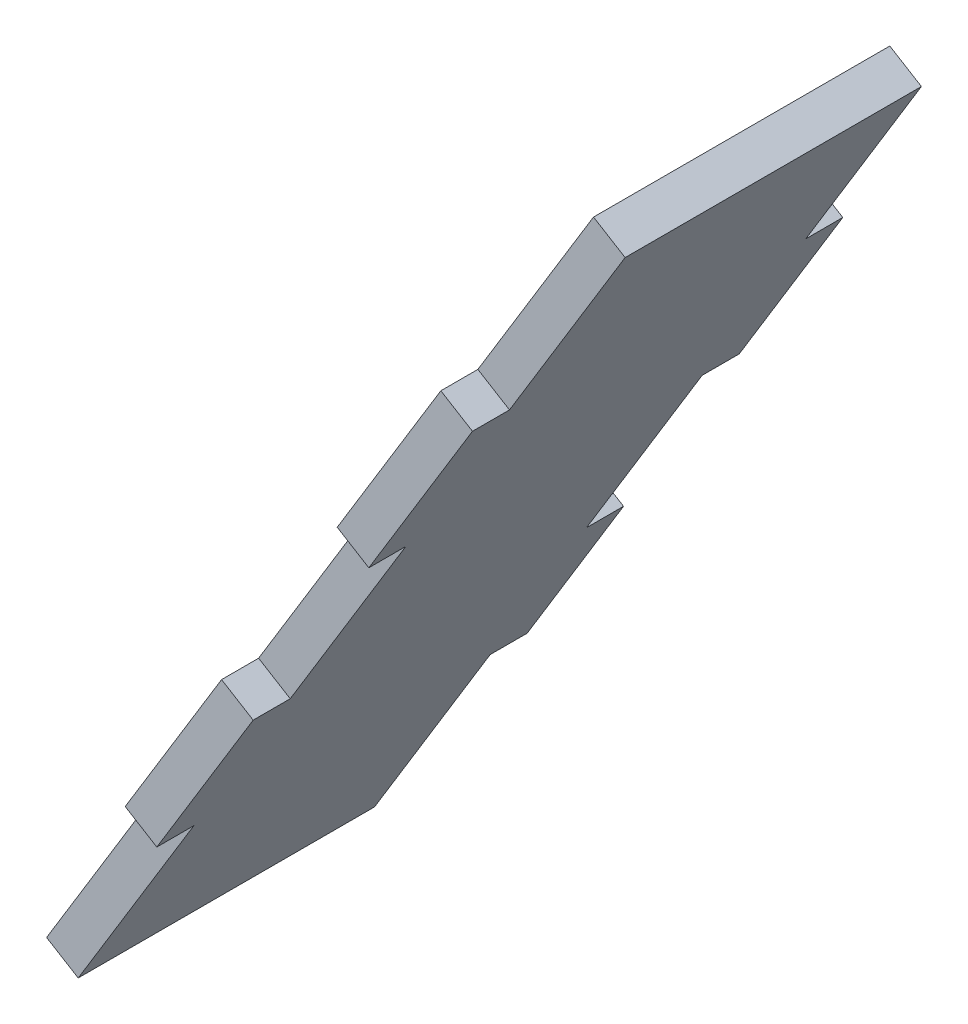
ISO-10303-21;
HEADER;
FILE_DESCRIPTION(('STEP AP214'),'2;1');
FILE_NAME('part.step','',(''),(''),'','','');
FILE_SCHEMA(('AUTOMOTIVE_DESIGN { 1 0 10303 214 1 1 1 1 }'));
ENDSEC;
DATA;
#1=APPLICATION_CONTEXT('core data for automotive mechanical design processes');
#2=APPLICATION_PROTOCOL_DEFINITION('international standard','automotive_design',2000,#1);
#3=PRODUCT_CONTEXT('',#1,'mechanical');
#4=PRODUCT('Part','Part','',(#3));
#5=PRODUCT_RELATED_PRODUCT_CATEGORY('part','',(#4));
#6=PRODUCT_DEFINITION_FORMATION('','',#4);
#7=PRODUCT_DEFINITION_CONTEXT('part definition',#1,'design');
#8=PRODUCT_DEFINITION('design','',#6,#7);
#9=PRODUCT_DEFINITION_SHAPE('','',#8);
#10=(LENGTH_UNIT() NAMED_UNIT(*) SI_UNIT(.MILLI.,.METRE.));
#11=(NAMED_UNIT(*) PLANE_ANGLE_UNIT() SI_UNIT($,.RADIAN.));
#12=(NAMED_UNIT(*) SI_UNIT($,.STERADIAN.) SOLID_ANGLE_UNIT());
#13=UNCERTAINTY_MEASURE_WITH_UNIT(LENGTH_MEASURE(1.E-05),#10,'distance_accuracy_value','');
#14=(GEOMETRIC_REPRESENTATION_CONTEXT(3) GLOBAL_UNCERTAINTY_ASSIGNED_CONTEXT((#13)) GLOBAL_UNIT_ASSIGNED_CONTEXT((#10,
#11,#12)) REPRESENTATION_CONTEXT('',''));
#15=CARTESIAN_POINT('',(0.,0.,0.));
#16=DIRECTION('',(0.,0.,1.));
#17=DIRECTION('',(1.,0.,0.));
#18=AXIS2_PLACEMENT_3D('',#15,#16,#17);
#19=CARTESIAN_POINT('',(0.,0.,0.));
#20=DIRECTION('',(0.,0.,-1.));
#21=DIRECTION('',(-1.,0.,0.));
#22=AXIS2_PLACEMENT_3D('',#19,#20,#21);
#23=PLANE('',#22);
#24=DIRECTION('',(-0.520428763090287,-0.853905089894839,0.));
#25=VECTOR('',#24,1.);
#26=CARTESIAN_POINT('',(472.905042096675,313.34761658217,0.));
#27=LINE('',#26,#25);
#28=CARTESIAN_POINT('',(444.192843531237,266.237436984267,0.));
#29=VERTEX_POINT('',#28);
#30=CARTESIAN_POINT('',(435.931036917179,252.681693682186,0.));
#31=VERTEX_POINT('',#30);
#32=EDGE_CURVE('E311',#29,#31,#27,.T.);
#33=ORIENTED_EDGE('',*,*,#32,.F.);
#34=DIRECTION('',(0.853905089894839,-0.520428763090287,0.));
#35=VECTOR('',#34,1.);
#36=CARTESIAN_POINT('',(441.481694870821,267.889798307078,0.));
#37=LINE('',#36,#35);
#38=CARTESIAN_POINT('',(441.481694870821,267.889798307078,0.));
#39=VERTEX_POINT('',#38);
#40=EDGE_CURVE('E202',#39,#29,#37,.T.);
#41=ORIENTED_EDGE('',*,*,#40,.F.);
#42=DIRECTION('',(0.520428763090287,0.853905089894839,0.));
#43=VECTOR('',#42,1.);
#44=CARTESIAN_POINT('',(423.305720319893,238.067163042501,0.));
#45=LINE('',#44,#43);
#46=CARTESIAN_POINT('',(433.219888256763,254.334055004998,0.));
#47=VERTEX_POINT('',#46);
#48=EDGE_CURVE('E304',#47,#39,#45,.T.);
#49=ORIENTED_EDGE('',*,*,#48,.F.);
#50=DIRECTION('',(0.853905089894839,-0.520428763090287,0.));
#51=VECTOR('',#50,1.);
#52=CARTESIAN_POINT('',(433.219888256763,254.334055004998,0.));
#53=LINE('',#52,#51);
#54=EDGE_CURVE('E260',#47,#31,#53,.T.);
#55=ORIENTED_EDGE('',*,*,#54,.T.);
#56=EDGE_LOOP('',(#33,#41,#49,#55));
#57=FACE_BOUND('',#56,.T.);
#58=ADVANCED_FACE('F33',(#57),#23,.F.);
#59=CARTESIAN_POINT('',(479.935588645273,204.404353237433,-31.7500000000001));
#60=DIRECTION('',(0.,0.,-1.));
#61=DIRECTION('',(-1.,0.,0.));
#62=AXIS2_PLACEMENT_3D('',#59,#60,#61);
#63=PLANE('',#62);
#64=DIRECTION('',(0.853905089894839,-0.520428763090287,0.));
#65=VECTOR('',#64,1.);
#66=CARTESIAN_POINT('',(451.395862807691,284.156690269575,-31.7499999999999));
#67=LINE('',#66,#65);
#68=CARTESIAN_POINT('',(451.395862807691,284.156690269575,-31.7499999999999));
#69=VERTEX_POINT('',#68);
#70=CARTESIAN_POINT('',(454.107011468107,282.504328946763,-31.7499999999999));
#71=VERTEX_POINT('',#70);
#72=EDGE_CURVE('E224',#69,#71,#67,.T.);
#73=ORIENTED_EDGE('',*,*,#72,.F.);
#74=DIRECTION('',(0.520428763090287,0.853905089894839,0.));
#75=VECTOR('',#74,1.);
#76=CARTESIAN_POINT('',(423.305720319893,238.067163042501,-31.7500000000001));
#77=LINE('',#76,#75);
#78=CARTESIAN_POINT('',(460.279725499389,298.733085942485,-31.7499999999999));
#79=VERTEX_POINT('',#78);
#80=EDGE_CURVE('E306',#69,#79,#77,.T.);
#81=ORIENTED_EDGE('',*,*,#80,.T.);
#82=DIRECTION('',(0.853905089894839,-0.520428763090287,0.));
#83=VECTOR('',#82,1.);
#84=CARTESIAN_POINT('',(460.279725499389,298.733085942485,-31.7499999999999));
#85=LINE('',#84,#83);
#86=CARTESIAN_POINT('',(462.990874159805,297.080724619674,-31.7500000000001));
#87=VERTEX_POINT('',#86);
#88=EDGE_CURVE('E279',#79,#87,#85,.T.);
#89=ORIENTED_EDGE('',*,*,#88,.T.);
#90=DIRECTION('',(-0.520428763090288,-0.853905089894839,0.));
#91=VECTOR('',#90,1.);
#92=CARTESIAN_POINT('',(472.905042096675,313.34761658217,-31.7500000000001));
#93=LINE('',#92,#91);
#94=EDGE_CURVE('E11',#87,#71,#93,.T.);
#95=ORIENTED_EDGE('',*,*,#94,.T.);
#96=EDGE_LOOP('',(#73,#81,#89,#95));
#97=FACE_BOUND('',#96,.T.);
#98=ADVANCED_FACE('F353',(#97),#63,.T.);
#99=CARTESIAN_POINT('',(470.193893436258,314.999977904982,-124.678588909927));
#100=DIRECTION('',(-0.520428763090287,-0.853905089894839,0.));
#101=DIRECTION('',(0.853905089894839,-0.520428763090287,0.));
#102=AXIS2_PLACEMENT_3D('',#99,#100,#101);
#103=PLANE('',#102);
#104=DIRECTION('',(0.,0.,1.));
#105=VECTOR('',#104,1.);
#106=CARTESIAN_POINT('',(472.905042096675,313.34761658217,-124.678588909927));
#107=LINE('',#106,#105);
#108=CARTESIAN_POINT('',(472.905042096675,313.34761658217,-28.5749999999999));
#109=VERTEX_POINT('',#108);
#110=CARTESIAN_POINT('',(472.905042096675,313.34761658217,-3.17499999999998));
#111=VERTEX_POINT('',#110);
#112=EDGE_CURVE('E316',#109,#111,#107,.T.);
#113=ORIENTED_EDGE('',*,*,#112,.F.);
#114=DIRECTION('',(0.853905089894839,-0.520428763090287,0.));
#115=VECTOR('',#114,1.);
#116=CARTESIAN_POINT('',(470.193893436259,314.999977904982,-28.5749999999999));
#117=LINE('',#116,#115);
#118=CARTESIAN_POINT('',(470.193893436259,314.999977904982,-28.5749999999999));
#119=VERTEX_POINT('',#118);
#120=EDGE_CURVE('E275',#119,#109,#117,.T.);
#121=ORIENTED_EDGE('',*,*,#120,.F.);
#122=DIRECTION('',(0.,0.,1.));
#123=VECTOR('',#122,1.);
#124=CARTESIAN_POINT('',(470.193893436258,314.999977904982,-124.678588909927));
#125=LINE('',#124,#123);
#126=CARTESIAN_POINT('',(470.193893436259,314.999977904982,-3.17499999999998));
#127=VERTEX_POINT('',#126);
#128=EDGE_CURVE('E37',#119,#127,#125,.T.);
#129=ORIENTED_EDGE('',*,*,#128,.T.);
#130=DIRECTION('',(0.853905089894839,-0.520428763090287,0.));
#131=VECTOR('',#130,1.);
#132=CARTESIAN_POINT('',(470.193893436259,314.999977904982,-3.17499999999998));
#133=LINE('',#132,#131);
#134=EDGE_CURVE('E298',#127,#111,#133,.T.);
#135=ORIENTED_EDGE('',*,*,#134,.T.);
#136=EDGE_LOOP('',(#113,#121,#129,#135));
#137=FACE_BOUND('',#136,.T.);
#138=ADVANCED_FACE('F339',(#137),#103,.F.);
#139=CARTESIAN_POINT('',(472.905042096675,313.34761658217,-124.678588909927));
#140=DIRECTION('',(-0.853905089894839,0.520428763090288,0.));
#141=DIRECTION('',(-0.520428763090288,-0.853905089894839,0.));
#142=AXIS2_PLACEMENT_3D('',#139,#140,#141);
#143=PLANE('',#142);
#144=DIRECTION('',(0.520428763090286,0.85390508989484,0.));
#145=VECTOR('',#144,1.);
#146=CARTESIAN_POINT('',(444.192843531237,266.237436984267,-3.17499999999997));
#147=LINE('',#146,#145);
#148=CARTESIAN_POINT('',(444.192843531237,266.237436984267,-3.17499999999997));
#149=VERTEX_POINT('',#148);
#150=CARTESIAN_POINT('',(454.107011468107,282.504328946763,-3.17499999999997));
#151=VERTEX_POINT('',#150);
#152=EDGE_CURVE('E179',#149,#151,#147,.T.);
#153=ORIENTED_EDGE('',*,*,#152,.F.);
#154=DIRECTION('',(0.,0.,-1.));
#155=VECTOR('',#154,1.);
#156=CARTESIAN_POINT('',(444.192843531237,266.237436984267,-3.17499999999997));
#157=LINE('',#156,#155);
#158=EDGE_CURVE('E191',#29,#149,#157,.T.);
#159=ORIENTED_EDGE('',*,*,#158,.F.);
#160=ORIENTED_EDGE('',*,*,#32,.T.);
#161=DIRECTION('',(0.,0.,1.));
#162=VECTOR('',#161,1.);
#163=CARTESIAN_POINT('',(435.931036917179,252.681693682186,0.));
#164=LINE('',#163,#162);
#165=CARTESIAN_POINT('',(435.931036917179,252.681693682186,-3.17499999999997));
#166=VERTEX_POINT('',#165);
#167=EDGE_CURVE('E252',#166,#31,#164,.T.);
#168=ORIENTED_EDGE('',*,*,#167,.F.);
#169=DIRECTION('',(0.520428763090288,0.853905089894839,0.));
#170=VECTOR('',#169,1.);
#171=CARTESIAN_POINT('',(426.016868980309,236.414801719689,-3.17499999999997));
#172=LINE('',#171,#170);
#173=CARTESIAN_POINT('',(426.016868980309,236.414801719689,-3.17499999999997));
#174=VERTEX_POINT('',#173);
#175=EDGE_CURVE('E242',#174,#166,#172,.T.);
#176=ORIENTED_EDGE('',*,*,#175,.F.);
#177=DIRECTION('',(0.,0.,1.));
#178=VECTOR('',#177,1.);
#179=CARTESIAN_POINT('',(426.016868980309,236.414801719689,-124.678588909927));
#180=LINE('',#179,#178);
#181=CARTESIAN_POINT('',(426.016868980309,236.414801719689,-28.5749999999999));
#182=VERTEX_POINT('',#181);
#183=EDGE_CURVE('E310',#182,#174,#180,.T.);
#184=ORIENTED_EDGE('',*,*,#183,.F.);
#185=DIRECTION('',(-0.520428763090288,-0.853905089894839,0.));
#186=VECTOR('',#185,1.);
#187=CARTESIAN_POINT('',(435.931036917179,252.681693682186,-28.5749999999999));
#188=LINE('',#187,#186);
#189=CARTESIAN_POINT('',(435.931036917179,252.681693682186,-28.5749999999999));
#190=VERTEX_POINT('',#189);
#191=EDGE_CURVE('E223',#190,#182,#188,.T.);
#192=ORIENTED_EDGE('',*,*,#191,.F.);
#193=DIRECTION('',(0.,0.,1.));
#194=VECTOR('',#193,1.);
#195=CARTESIAN_POINT('',(435.931036917179,252.681693682186,-28.5749999999999));
#196=LINE('',#195,#194);
#197=CARTESIAN_POINT('',(435.931036917179,252.681693682186,-31.7499999999999));
#198=VERTEX_POINT('',#197);
#199=EDGE_CURVE('E233',#198,#190,#196,.T.);
#200=ORIENTED_EDGE('',*,*,#199,.F.);
#201=CARTESIAN_POINT('',(444.192843531237,266.237436984267,-31.7500000000001));
#202=VERTEX_POINT('',#201);
#203=EDGE_CURVE('E42',#202,#198,#93,.T.);
#204=ORIENTED_EDGE('',*,*,#203,.F.);
#205=DIRECTION('',(0.,0.,-1.));
#206=VECTOR('',#205,1.);
#207=CARTESIAN_POINT('',(444.192843531237,266.237436984267,-28.5749999999999));
#208=LINE('',#207,#206);
#209=CARTESIAN_POINT('',(444.192843531237,266.237436984267,-28.5749999999999));
#210=VERTEX_POINT('',#209);
#211=EDGE_CURVE('E58',#210,#202,#208,.T.);
#212=ORIENTED_EDGE('',*,*,#211,.F.);
#213=DIRECTION('',(-0.520428763090286,-0.85390508989484,0.));
#214=VECTOR('',#213,1.);
#215=CARTESIAN_POINT('',(454.107011468107,282.504328946763,-28.5749999999999));
#216=LINE('',#215,#214);
#217=CARTESIAN_POINT('',(454.107011468107,282.504328946763,-28.5749999999999));
#218=VERTEX_POINT('',#217);
#219=EDGE_CURVE('E201',#218,#210,#216,.T.);
#220=ORIENTED_EDGE('',*,*,#219,.F.);
#221=DIRECTION('',(0.,0.,1.));
#222=VECTOR('',#221,1.);
#223=CARTESIAN_POINT('',(454.107011468107,282.504328946763,-28.5749999999999));
#224=LINE('',#223,#222);
#225=EDGE_CURVE('E209',#71,#218,#224,.T.);
#226=ORIENTED_EDGE('',*,*,#225,.F.);
#227=ORIENTED_EDGE('',*,*,#94,.F.);
#228=DIRECTION('',(0.,0.,-1.));
#229=VECTOR('',#228,1.);
#230=CARTESIAN_POINT('',(462.990874159805,297.080724619674,-31.7499999999999));
#231=LINE('',#230,#229);
#232=CARTESIAN_POINT('',(462.990874159805,297.080724619674,-28.5749999999999));
#233=VERTEX_POINT('',#232);
#234=EDGE_CURVE('E272',#233,#87,#231,.T.);
#235=ORIENTED_EDGE('',*,*,#234,.F.);
#236=DIRECTION('',(-0.520428763090288,-0.853905089894839,0.));
#237=VECTOR('',#236,1.);
#238=CARTESIAN_POINT('',(472.905042096675,313.34761658217,-28.5749999999999));
#239=LINE('',#238,#237);
#240=EDGE_CURVE('E263',#109,#233,#239,.T.);
#241=ORIENTED_EDGE('',*,*,#240,.F.);
#242=ORIENTED_EDGE('',*,*,#112,.T.);
#243=DIRECTION('',(0.520428763090288,0.853905089894839,0.));
#244=VECTOR('',#243,1.);
#245=CARTESIAN_POINT('',(472.905042096675,313.34761658217,-3.17499999999998));
#246=LINE('',#245,#244);
#247=CARTESIAN_POINT('',(462.990874159805,297.080724619674,-3.17499999999998));
#248=VERTEX_POINT('',#247);
#249=EDGE_CURVE('E290',#248,#111,#246,.T.);
#250=ORIENTED_EDGE('',*,*,#249,.F.);
#251=DIRECTION('',(0.,0.,-1.));
#252=VECTOR('',#251,1.);
#253=CARTESIAN_POINT('',(462.990874159805,297.080724619674,0.));
#254=LINE('',#253,#252);
#255=CARTESIAN_POINT('',(462.990874159805,297.080724619674,0.));
#256=VERTEX_POINT('',#255);
#257=EDGE_CURVE('E282',#256,#248,#254,.T.);
#258=ORIENTED_EDGE('',*,*,#257,.F.);
#259=CARTESIAN_POINT('',(454.107011468107,282.504328946763,0.));
#260=VERTEX_POINT('',#259);
#261=EDGE_CURVE('E308',#256,#260,#27,.T.);
#262=ORIENTED_EDGE('',*,*,#261,.T.);
#263=DIRECTION('',(0.,0.,1.));
#264=VECTOR('',#263,1.);
#265=CARTESIAN_POINT('',(454.107011468107,282.504328946763,-3.17499999999997));
#266=LINE('',#265,#264);
#267=EDGE_CURVE('E50',#151,#260,#266,.T.);
#268=ORIENTED_EDGE('',*,*,#267,.F.);
#269=EDGE_LOOP('',(#153,#159,#160,#168,#176,#184,#192,#200,#204,#212,#220,#226,#227,#235,#241,
#242,#250,#258,#262,#268));
#270=FACE_BOUND('',#269,.T.);
#271=ADVANCED_FACE('F331',(#270),#143,.F.);
#272=CARTESIAN_POINT('',(426.016868980309,236.414801719689,-124.678588909927));
#273=DIRECTION('',(0.520428763090281,0.853905089894843,0.));
#274=DIRECTION('',(-0.853905089894843,0.520428763090281,0.));
#275=AXIS2_PLACEMENT_3D('',#272,#273,#274);
#276=PLANE('',#275);
#277=DIRECTION('',(0.,0.,1.));
#278=VECTOR('',#277,1.);
#279=CARTESIAN_POINT('',(423.305720319893,238.067163042501,-124.678588909927));
#280=LINE('',#279,#278);
#281=CARTESIAN_POINT('',(423.305720319893,238.067163042501,-28.5749999999999));
#282=VERTEX_POINT('',#281);
#283=CARTESIAN_POINT('',(423.305720319893,238.067163042501,-3.17499999999997));
#284=VERTEX_POINT('',#283);
#285=EDGE_CURVE('E318',#282,#284,#280,.T.);
#286=ORIENTED_EDGE('',*,*,#285,.F.);
#287=DIRECTION('',(0.853905089894839,-0.520428763090287,0.));
#288=VECTOR('',#287,1.);
#289=CARTESIAN_POINT('',(423.305720319893,238.067163042501,-28.5749999999999));
#290=LINE('',#289,#288);
#291=EDGE_CURVE('E236',#282,#182,#290,.T.);
#292=ORIENTED_EDGE('',*,*,#291,.T.);
#293=ORIENTED_EDGE('',*,*,#183,.T.);
#294=DIRECTION('',(0.853905089894839,-0.520428763090287,0.));
#295=VECTOR('',#294,1.);
#296=CARTESIAN_POINT('',(423.305720319893,238.067163042501,-3.17499999999997));
#297=LINE('',#296,#295);
#298=EDGE_CURVE('E255',#284,#174,#297,.T.);
#299=ORIENTED_EDGE('',*,*,#298,.F.);
#300=EDGE_LOOP('',(#286,#292,#293,#299));
#301=FACE_BOUND('',#300,.T.);
#302=ADVANCED_FACE('F376',(#301),#276,.F.);
#303=CARTESIAN_POINT('',(423.305720319893,238.067163042501,-124.678588909927));
#304=DIRECTION('',(0.853905089894839,-0.520428763090287,0.));
#305=DIRECTION('',(0.520428763090287,0.853905089894839,0.));
#306=AXIS2_PLACEMENT_3D('',#303,#304,#305);
#307=PLANE('',#306);
#308=ORIENTED_EDGE('',*,*,#48,.T.);
#309=DIRECTION('',(0.,0.,-1.));
#310=VECTOR('',#309,1.);
#311=CARTESIAN_POINT('',(441.481694870821,267.889798307078,-3.17499999999997));
#312=LINE('',#311,#310);
#313=CARTESIAN_POINT('',(441.481694870821,267.889798307078,-3.17499999999997));
#314=VERTEX_POINT('',#313);
#315=EDGE_CURVE('E181',#39,#314,#312,.T.);
#316=ORIENTED_EDGE('',*,*,#315,.T.);
#317=DIRECTION('',(0.520428763090286,0.85390508989484,0.));
#318=VECTOR('',#317,1.);
#319=CARTESIAN_POINT('',(441.481694870821,267.889798307078,-3.17499999999997));
#320=LINE('',#319,#318);
#321=CARTESIAN_POINT('',(451.395862807691,284.156690269575,-3.17499999999997));
#322=VERTEX_POINT('',#321);
#323=EDGE_CURVE('E176',#314,#322,#320,.T.);
#324=ORIENTED_EDGE('',*,*,#323,.T.);
#325=DIRECTION('',(0.,0.,1.));
#326=VECTOR('',#325,1.);
#327=CARTESIAN_POINT('',(451.395862807691,284.156690269575,-3.17499999999997));
#328=LINE('',#327,#326);
#329=CARTESIAN_POINT('',(451.395862807691,284.156690269575,0.));
#330=VERTEX_POINT('',#329);
#331=EDGE_CURVE('E184',#322,#330,#328,.T.);
#332=ORIENTED_EDGE('',*,*,#331,.T.);
#333=CARTESIAN_POINT('',(460.279725499389,298.733085942485,0.));
#334=VERTEX_POINT('',#333);
#335=EDGE_CURVE('E307',#330,#334,#45,.T.);
#336=ORIENTED_EDGE('',*,*,#335,.T.);
#337=DIRECTION('',(0.,0.,-1.));
#338=VECTOR('',#337,1.);
#339=CARTESIAN_POINT('',(460.279725499389,298.733085942485,0.));
#340=LINE('',#339,#338);
#341=CARTESIAN_POINT('',(460.279725499389,298.733085942485,-3.17499999999998));
#342=VERTEX_POINT('',#341);
#343=EDGE_CURVE('E286',#334,#342,#340,.T.);
#344=ORIENTED_EDGE('',*,*,#343,.T.);
#345=DIRECTION('',(0.520428763090288,0.853905089894839,0.));
#346=VECTOR('',#345,1.);
#347=CARTESIAN_POINT('',(470.193893436259,314.999977904982,-3.17499999999998));
#348=LINE('',#347,#346);
#349=EDGE_CURVE('E289',#342,#127,#348,.T.);
#350=ORIENTED_EDGE('',*,*,#349,.T.);
#351=ORIENTED_EDGE('',*,*,#128,.F.);
#352=DIRECTION('',(-0.520428763090288,-0.853905089894839,0.));
#353=VECTOR('',#352,1.);
#354=CARTESIAN_POINT('',(470.193893436259,314.999977904982,-28.5749999999999));
#355=LINE('',#354,#353);
#356=CARTESIAN_POINT('',(460.279725499389,298.733085942485,-28.5749999999999));
#357=VERTEX_POINT('',#356);
#358=EDGE_CURVE('E268',#119,#357,#355,.T.);
#359=ORIENTED_EDGE('',*,*,#358,.T.);
#360=DIRECTION('',(0.,0.,-1.));
#361=VECTOR('',#360,1.);
#362=CARTESIAN_POINT('',(460.279725499389,298.733085942485,-31.7499999999999));
#363=LINE('',#362,#361);
#364=EDGE_CURVE('E271',#357,#79,#363,.T.);
#365=ORIENTED_EDGE('',*,*,#364,.T.);
#366=ORIENTED_EDGE('',*,*,#80,.F.);
#367=DIRECTION('',(0.,0.,1.));
#368=VECTOR('',#367,1.);
#369=CARTESIAN_POINT('',(451.395862807691,284.156690269575,-28.5749999999999));
#370=LINE('',#369,#368);
#371=CARTESIAN_POINT('',(451.395862807691,284.156690269575,-28.5749999999999));
#372=VERTEX_POINT('',#371);
#373=EDGE_CURVE('E212',#69,#372,#370,.T.);
#374=ORIENTED_EDGE('',*,*,#373,.T.);
#375=DIRECTION('',(-0.520428763090286,-0.85390508989484,0.));
#376=VECTOR('',#375,1.);
#377=CARTESIAN_POINT('',(451.395862807691,284.156690269575,-28.5749999999999));
#378=LINE('',#377,#376);
#379=CARTESIAN_POINT('',(441.481694870821,267.889798307078,-28.5749999999999));
#380=VERTEX_POINT('',#379);
#381=EDGE_CURVE('E205',#372,#380,#378,.T.);
#382=ORIENTED_EDGE('',*,*,#381,.T.);
#383=DIRECTION('',(0.,0.,-1.));
#384=VECTOR('',#383,1.);
#385=CARTESIAN_POINT('',(441.481694870821,267.889798307078,-28.5749999999999));
#386=LINE('',#385,#384);
#387=CARTESIAN_POINT('',(441.481694870821,267.889798307078,-31.7499999999999));
#388=VERTEX_POINT('',#387);
#389=EDGE_CURVE('E208',#380,#388,#386,.T.);
#390=ORIENTED_EDGE('',*,*,#389,.T.);
#391=CARTESIAN_POINT('',(433.219888256763,254.334055004998,-31.7500000000001));
#392=VERTEX_POINT('',#391);
#393=EDGE_CURVE('E313',#392,#388,#77,.T.);
#394=ORIENTED_EDGE('',*,*,#393,.F.);
#395=DIRECTION('',(0.,0.,1.));
#396=VECTOR('',#395,1.);
#397=CARTESIAN_POINT('',(433.219888256763,254.334055004998,-28.5749999999999));
#398=LINE('',#397,#396);
#399=CARTESIAN_POINT('',(433.219888256763,254.334055004998,-28.5749999999999));
#400=VERTEX_POINT('',#399);
#401=EDGE_CURVE('E232',#392,#400,#398,.T.);
#402=ORIENTED_EDGE('',*,*,#401,.T.);
#403=DIRECTION('',(-0.520428763090288,-0.853905089894839,0.));
#404=VECTOR('',#403,1.);
#405=CARTESIAN_POINT('',(433.219888256763,254.334055004998,-28.5749999999999));
#406=LINE('',#405,#404);
#407=EDGE_CURVE('E229',#400,#282,#406,.T.);
#408=ORIENTED_EDGE('',*,*,#407,.T.);
#409=ORIENTED_EDGE('',*,*,#285,.T.);
#410=DIRECTION('',(0.520428763090288,0.853905089894839,0.));
#411=VECTOR('',#410,1.);
#412=CARTESIAN_POINT('',(423.305720319893,238.067163042501,-3.17499999999997));
#413=LINE('',#412,#411);
#414=CARTESIAN_POINT('',(433.219888256763,254.334055004998,-3.17499999999997));
#415=VERTEX_POINT('',#414);
#416=EDGE_CURVE('E248',#284,#415,#413,.T.);
#417=ORIENTED_EDGE('',*,*,#416,.T.);
#418=DIRECTION('',(0.,0.,1.));
#419=VECTOR('',#418,1.);
#420=CARTESIAN_POINT('',(433.219888256763,254.334055004998,0.));
#421=LINE('',#420,#419);
#422=EDGE_CURVE('E251',#415,#47,#421,.T.);
#423=ORIENTED_EDGE('',*,*,#422,.T.);
#424=EDGE_LOOP('',(#308,#316,#324,#332,#336,#344,#350,#351,#359,#365,#366,#374,#382,#390,#394,
#402,#408,#409,#417,#423));
#425=FACE_BOUND('',#424,.T.);
#426=ADVANCED_FACE('F190',(#425),#307,.F.);
#427=ORIENTED_EDGE('',*,*,#335,.F.);
#428=DIRECTION('',(0.853905089894839,-0.520428763090287,0.));
#429=VECTOR('',#428,1.);
#430=CARTESIAN_POINT('',(451.395862807691,284.156690269575,0.));
#431=LINE('',#430,#429);
#432=EDGE_CURVE('E180',#330,#260,#431,.T.);
#433=ORIENTED_EDGE('',*,*,#432,.T.);
#434=ORIENTED_EDGE('',*,*,#261,.F.);
#435=DIRECTION('',(0.853905089894839,-0.520428763090287,0.));
#436=VECTOR('',#435,1.);
#437=CARTESIAN_POINT('',(460.279725499389,298.733085942485,0.));
#438=LINE('',#437,#436);
#439=EDGE_CURVE('E293',#334,#256,#438,.T.);
#440=ORIENTED_EDGE('',*,*,#439,.F.);
#441=EDGE_LOOP('',(#427,#433,#434,#440));
#442=FACE_BOUND('',#441,.T.);
#443=ADVANCED_FACE('F329',(#442),#23,.F.);
#444=DIRECTION('',(0.853905089894839,-0.520428763090287,0.));
#445=VECTOR('',#444,1.);
#446=CARTESIAN_POINT('',(441.481694870821,267.889798307078,-31.7499999999999));
#447=LINE('',#446,#445);
#448=EDGE_CURVE('E226',#388,#202,#447,.T.);
#449=ORIENTED_EDGE('',*,*,#448,.T.);
#450=ORIENTED_EDGE('',*,*,#203,.T.);
#451=DIRECTION('',(0.853905089894839,-0.520428763090287,0.));
#452=VECTOR('',#451,1.);
#453=CARTESIAN_POINT('',(433.219888256763,254.334055004998,-31.7499999999999));
#454=LINE('',#453,#452);
#455=EDGE_CURVE('E243',#392,#198,#454,.T.);
#456=ORIENTED_EDGE('',*,*,#455,.F.);
#457=ORIENTED_EDGE('',*,*,#393,.T.);
#458=EDGE_LOOP('',(#449,#450,#456,#457));
#459=FACE_BOUND('',#458,.T.);
#460=ADVANCED_FACE('F35',(#459),#63,.T.);
#461=CARTESIAN_POINT('',(470.193893436259,314.999977904982,-3.17499999999998));
#462=DIRECTION('',(0.,0.,-1.));
#463=DIRECTION('',(-1.,0.,0.));
#464=AXIS2_PLACEMENT_3D('',#461,#462,#463);
#465=PLANE('',#464);
#466=ORIENTED_EDGE('',*,*,#249,.T.);
#467=ORIENTED_EDGE('',*,*,#134,.F.);
#468=ORIENTED_EDGE('',*,*,#349,.F.);
#469=DIRECTION('',(0.853905089894839,-0.520428763090287,0.));
#470=VECTOR('',#469,1.);
#471=CARTESIAN_POINT('',(460.279725499389,298.733085942485,-3.17499999999998));
#472=LINE('',#471,#470);
#473=EDGE_CURVE('E301',#342,#248,#472,.T.);
#474=ORIENTED_EDGE('',*,*,#473,.T.);
#475=EDGE_LOOP('',(#466,#467,#468,#474));
#476=FACE_BOUND('',#475,.T.);
#477=ADVANCED_FACE('F337',(#476),#465,.F.);
#478=CARTESIAN_POINT('',(460.279725499389,298.733085942485,0.));
#479=DIRECTION('',(-0.520428763090287,-0.853905089894839,0.));
#480=DIRECTION('',(0.853905089894839,-0.520428763090287,0.));
#481=AXIS2_PLACEMENT_3D('',#478,#479,#480);
#482=PLANE('',#481);
#483=ORIENTED_EDGE('',*,*,#257,.T.);
#484=ORIENTED_EDGE('',*,*,#473,.F.);
#485=ORIENTED_EDGE('',*,*,#343,.F.);
#486=ORIENTED_EDGE('',*,*,#439,.T.);
#487=EDGE_LOOP('',(#483,#484,#485,#486));
#488=FACE_BOUND('',#487,.T.);
#489=ADVANCED_FACE('F325',(#488),#482,.F.);
#490=CARTESIAN_POINT('',(460.279725499389,298.733085942485,-31.7499999999999));
#491=DIRECTION('',(-0.520428763090287,-0.853905089894839,0.));
#492=DIRECTION('',(0.853905089894839,-0.520428763090287,0.));
#493=AXIS2_PLACEMENT_3D('',#490,#491,#492);
#494=PLANE('',#493);
#495=ORIENTED_EDGE('',*,*,#234,.T.);
#496=ORIENTED_EDGE('',*,*,#88,.F.);
#497=ORIENTED_EDGE('',*,*,#364,.F.);
#498=DIRECTION('',(0.853905089894839,-0.520428763090287,0.));
#499=VECTOR('',#498,1.);
#500=CARTESIAN_POINT('',(460.279725499389,298.733085942485,-28.5749999999999));
#501=LINE('',#500,#499);
#502=EDGE_CURVE('E283',#357,#233,#501,.T.);
#503=ORIENTED_EDGE('',*,*,#502,.T.);
#504=EDGE_LOOP('',(#495,#496,#497,#503));
#505=FACE_BOUND('',#504,.T.);
#506=ADVANCED_FACE('F349',(#505),#494,.F.);
#507=CARTESIAN_POINT('',(470.193893436259,314.999977904982,-28.5749999999999));
#508=DIRECTION('',(0.,0.,1.));
#509=DIRECTION('',(1.,0.,0.));
#510=AXIS2_PLACEMENT_3D('',#507,#508,#509);
#511=PLANE('',#510);
#512=ORIENTED_EDGE('',*,*,#240,.T.);
#513=ORIENTED_EDGE('',*,*,#502,.F.);
#514=ORIENTED_EDGE('',*,*,#358,.F.);
#515=ORIENTED_EDGE('',*,*,#120,.T.);
#516=EDGE_LOOP('',(#512,#513,#514,#515));
#517=FACE_BOUND('',#516,.T.);
#518=ADVANCED_FACE('F345',(#517),#511,.F.);
#519=CARTESIAN_POINT('',(433.219888256763,254.334055004998,0.));
#520=DIRECTION('',(0.520428763090287,0.853905089894839,0.));
#521=DIRECTION('',(-0.853905089894839,0.520428763090287,0.));
#522=AXIS2_PLACEMENT_3D('',#519,#520,#521);
#523=PLANE('',#522);
#524=ORIENTED_EDGE('',*,*,#167,.T.);
#525=ORIENTED_EDGE('',*,*,#54,.F.);
#526=ORIENTED_EDGE('',*,*,#422,.F.);
#527=DIRECTION('',(0.853905089894839,-0.520428763090287,0.));
#528=VECTOR('',#527,1.);
#529=CARTESIAN_POINT('',(433.219888256763,254.334055004998,-3.17499999999997));
#530=LINE('',#529,#528);
#531=EDGE_CURVE('E264',#415,#166,#530,.T.);
#532=ORIENTED_EDGE('',*,*,#531,.T.);
#533=EDGE_LOOP('',(#524,#525,#526,#532));
#534=FACE_BOUND('',#533,.T.);
#535=ADVANCED_FACE('F384',(#534),#523,.F.);
#536=CARTESIAN_POINT('',(423.305720319893,238.067163042501,-3.17499999999997));
#537=DIRECTION('',(0.,0.,-1.));
#538=DIRECTION('',(0.,1.,0.));
#539=AXIS2_PLACEMENT_3D('',#536,#537,#538);
#540=PLANE('',#539);
#541=ORIENTED_EDGE('',*,*,#175,.T.);
#542=ORIENTED_EDGE('',*,*,#531,.F.);
#543=ORIENTED_EDGE('',*,*,#416,.F.);
#544=ORIENTED_EDGE('',*,*,#298,.T.);
#545=EDGE_LOOP('',(#541,#542,#543,#544));
#546=FACE_BOUND('',#545,.T.);
#547=ADVANCED_FACE('F379',(#546),#540,.F.);
#548=CARTESIAN_POINT('',(433.219888256763,254.334055004998,-28.5749999999999));
#549=DIRECTION('',(0.,0.,1.));
#550=DIRECTION('',(0.,-1.,0.));
#551=AXIS2_PLACEMENT_3D('',#548,#549,#550);
#552=PLANE('',#551);
#553=ORIENTED_EDGE('',*,*,#191,.T.);
#554=ORIENTED_EDGE('',*,*,#291,.F.);
#555=ORIENTED_EDGE('',*,*,#407,.F.);
#556=DIRECTION('',(0.853905089894839,-0.520428763090287,0.));
#557=VECTOR('',#556,1.);
#558=CARTESIAN_POINT('',(433.219888256763,254.334055004998,-28.5749999999999));
#559=LINE('',#558,#557);
#560=EDGE_CURVE('E240',#400,#190,#559,.T.);
#561=ORIENTED_EDGE('',*,*,#560,.T.);
#562=EDGE_LOOP('',(#553,#554,#555,#561));
#563=FACE_BOUND('',#562,.T.);
#564=ADVANCED_FACE('F494',(#563),#552,.F.);
#565=CARTESIAN_POINT('',(433.219888256763,254.334055004998,-28.5749999999999));
#566=DIRECTION('',(0.520428763090287,0.853905089894839,0.));
#567=DIRECTION('',(-0.853905089894839,0.520428763090287,0.));
#568=AXIS2_PLACEMENT_3D('',#565,#566,#567);
#569=PLANE('',#568);
#570=ORIENTED_EDGE('',*,*,#199,.T.);
#571=ORIENTED_EDGE('',*,*,#560,.F.);
#572=ORIENTED_EDGE('',*,*,#401,.F.);
#573=ORIENTED_EDGE('',*,*,#455,.T.);
#574=EDGE_LOOP('',(#570,#571,#572,#573));
#575=FACE_BOUND('',#574,.T.);
#576=ADVANCED_FACE('F371',(#575),#569,.F.);
#577=CARTESIAN_POINT('',(451.395862807691,284.156690269575,-28.5749999999999));
#578=DIRECTION('',(0.,0.,1.));
#579=DIRECTION('',(0.,-1.,0.));
#580=AXIS2_PLACEMENT_3D('',#577,#578,#579);
#581=PLANE('',#580);
#582=ORIENTED_EDGE('',*,*,#219,.T.);
#583=DIRECTION('',(0.853905089894839,-0.520428763090287,0.));
#584=VECTOR('',#583,1.);
#585=CARTESIAN_POINT('',(441.481694870821,267.889798307078,-28.5749999999999));
#586=LINE('',#585,#584);
#587=EDGE_CURVE('E215',#380,#210,#586,.T.);
#588=ORIENTED_EDGE('',*,*,#587,.F.);
#589=ORIENTED_EDGE('',*,*,#381,.F.);
#590=DIRECTION('',(0.853905089894839,-0.520428763090287,0.));
#591=VECTOR('',#590,1.);
#592=CARTESIAN_POINT('',(451.395862807691,284.156690269575,-28.5749999999999));
#593=LINE('',#592,#591);
#594=EDGE_CURVE('E221',#372,#218,#593,.T.);
#595=ORIENTED_EDGE('',*,*,#594,.T.);
#596=EDGE_LOOP('',(#582,#588,#589,#595));
#597=FACE_BOUND('',#596,.T.);
#598=ADVANCED_FACE('F362',(#597),#581,.F.);
#599=CARTESIAN_POINT('',(451.395862807691,284.156690269575,-28.5749999999999));
#600=DIRECTION('',(0.520428763090287,0.853905089894839,0.));
#601=DIRECTION('',(-0.853905089894839,0.520428763090287,0.));
#602=AXIS2_PLACEMENT_3D('',#599,#600,#601);
#603=PLANE('',#602);
#604=ORIENTED_EDGE('',*,*,#225,.T.);
#605=ORIENTED_EDGE('',*,*,#594,.F.);
#606=ORIENTED_EDGE('',*,*,#373,.F.);
#607=ORIENTED_EDGE('',*,*,#72,.T.);
#608=EDGE_LOOP('',(#604,#605,#606,#607));
#609=FACE_BOUND('',#608,.T.);
#610=ADVANCED_FACE('F357',(#609),#603,.F.);
#611=CARTESIAN_POINT('',(441.481694870821,267.889798307078,-28.5749999999999));
#612=DIRECTION('',(-0.520428763090287,-0.853905089894839,0.));
#613=DIRECTION('',(0.853905089894839,-0.520428763090287,0.));
#614=AXIS2_PLACEMENT_3D('',#611,#612,#613);
#615=PLANE('',#614);
#616=ORIENTED_EDGE('',*,*,#211,.T.);
#617=ORIENTED_EDGE('',*,*,#448,.F.);
#618=ORIENTED_EDGE('',*,*,#389,.F.);
#619=ORIENTED_EDGE('',*,*,#587,.T.);
#620=EDGE_LOOP('',(#616,#617,#618,#619));
#621=FACE_BOUND('',#620,.T.);
#622=ADVANCED_FACE('F363',(#621),#615,.F.);
#623=CARTESIAN_POINT('',(441.481694870821,267.889798307078,-3.17499999999997));
#624=DIRECTION('',(0.,0.,-1.));
#625=DIRECTION('',(-1.,0.,0.));
#626=AXIS2_PLACEMENT_3D('',#623,#624,#625);
#627=PLANE('',#626);
#628=ORIENTED_EDGE('',*,*,#152,.T.);
#629=DIRECTION('',(0.853905089894839,-0.520428763090287,0.));
#630=VECTOR('',#629,1.);
#631=CARTESIAN_POINT('',(451.395862807691,284.156690269575,-3.17499999999997));
#632=LINE('',#631,#630);
#633=EDGE_CURVE('E172',#322,#151,#632,.T.);
#634=ORIENTED_EDGE('',*,*,#633,.F.);
#635=ORIENTED_EDGE('',*,*,#323,.F.);
#636=DIRECTION('',(0.853905089894839,-0.520428763090287,0.));
#637=VECTOR('',#636,1.);
#638=CARTESIAN_POINT('',(441.481694870821,267.889798307078,-3.17499999999997));
#639=LINE('',#638,#637);
#640=EDGE_CURVE('E199',#314,#149,#639,.T.);
#641=ORIENTED_EDGE('',*,*,#640,.T.);
#642=EDGE_LOOP('',(#628,#634,#635,#641));
#643=FACE_BOUND('',#642,.T.);
#644=ADVANCED_FACE('F174',(#643),#627,.F.);
#645=CARTESIAN_POINT('',(441.481694870821,267.889798307078,-3.17499999999997));
#646=DIRECTION('',(-0.520428763090287,-0.853905089894839,0.));
#647=DIRECTION('',(0.853905089894839,-0.520428763090287,0.));
#648=AXIS2_PLACEMENT_3D('',#645,#646,#647);
#649=PLANE('',#648);
#650=ORIENTED_EDGE('',*,*,#158,.T.);
#651=ORIENTED_EDGE('',*,*,#640,.F.);
#652=ORIENTED_EDGE('',*,*,#315,.F.);
#653=ORIENTED_EDGE('',*,*,#40,.T.);
#654=EDGE_LOOP('',(#650,#651,#652,#653));
#655=FACE_BOUND('',#654,.T.);
#656=ADVANCED_FACE('F390',(#655),#649,.F.);
#657=CARTESIAN_POINT('',(451.395862807691,284.156690269575,-3.17499999999997));
#658=DIRECTION('',(0.520428763090287,0.853905089894839,0.));
#659=DIRECTION('',(-0.853905089894839,0.520428763090287,0.));
#660=AXIS2_PLACEMENT_3D('',#657,#658,#659);
#661=PLANE('',#660);
#662=ORIENTED_EDGE('',*,*,#267,.T.);
#663=ORIENTED_EDGE('',*,*,#432,.F.);
#664=ORIENTED_EDGE('',*,*,#331,.F.);
#665=ORIENTED_EDGE('',*,*,#633,.T.);
#666=EDGE_LOOP('',(#662,#663,#664,#665));
#667=FACE_BOUND('',#666,.T.);
#668=ADVANCED_FACE('F185',(#667),#661,.F.);
#669=CLOSED_SHELL('',(#58,#98,#138,#271,#302,#426,#443,#460,#477,#489,#506,#518,#535,#547,#564,
#576,#598,#610,#622,#644,#656,#668));
#670=MANIFOLD_SOLID_BREP('B2',#669);
#671=ADVANCED_BREP_SHAPE_REPRESENTATION('',(#18,#670),#14);
#672=SHAPE_DEFINITION_REPRESENTATION(#9,#671);
ENDSEC;
END-ISO-10303-21;
